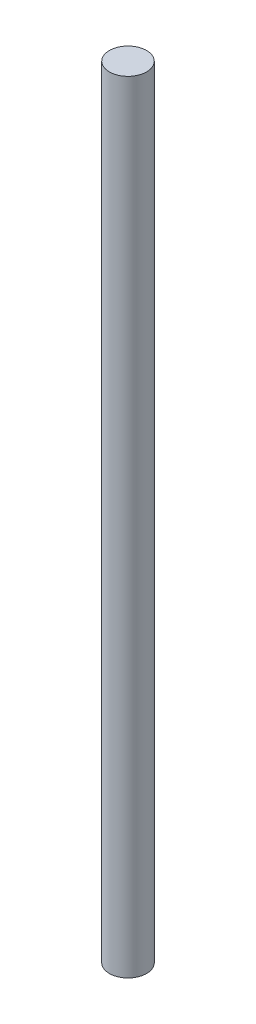
ISO-10303-21;
HEADER;
FILE_DESCRIPTION(('STEP AP214'),'2;1');
FILE_NAME('part.step','',(''),(''),'','','');
FILE_SCHEMA(('AUTOMOTIVE_DESIGN { 1 0 10303 214 1 1 1 1 }'));
ENDSEC;
DATA;
#1=APPLICATION_CONTEXT('core data for automotive mechanical design processes');
#2=APPLICATION_PROTOCOL_DEFINITION('international standard','automotive_design',2000,#1);
#3=PRODUCT_CONTEXT('',#1,'mechanical');
#4=PRODUCT('Part','Part','',(#3));
#5=PRODUCT_RELATED_PRODUCT_CATEGORY('part','',(#4));
#6=PRODUCT_DEFINITION_FORMATION('','',#4);
#7=PRODUCT_DEFINITION_CONTEXT('part definition',#1,'design');
#8=PRODUCT_DEFINITION('design','',#6,#7);
#9=PRODUCT_DEFINITION_SHAPE('','',#8);
#10=(LENGTH_UNIT() NAMED_UNIT(*) SI_UNIT(.MILLI.,.METRE.));
#11=(NAMED_UNIT(*) PLANE_ANGLE_UNIT() SI_UNIT($,.RADIAN.));
#12=(NAMED_UNIT(*) SI_UNIT($,.STERADIAN.) SOLID_ANGLE_UNIT());
#13=UNCERTAINTY_MEASURE_WITH_UNIT(LENGTH_MEASURE(1.E-05),#10,'distance_accuracy_value','');
#14=(GEOMETRIC_REPRESENTATION_CONTEXT(3) GLOBAL_UNCERTAINTY_ASSIGNED_CONTEXT((#13)) GLOBAL_UNIT_ASSIGNED_CONTEXT((#10,
#11,#12)) REPRESENTATION_CONTEXT('',''));
#15=CARTESIAN_POINT('',(0.,0.,0.));
#16=DIRECTION('',(0.,0.,1.));
#17=DIRECTION('',(1.,0.,0.));
#18=AXIS2_PLACEMENT_3D('',#15,#16,#17);
#19=CARTESIAN_POINT('',(0.,168.,0.));
#20=DIRECTION('',(0.,-1.,0.));
#21=DIRECTION('',(0.,0.,-1.));
#22=AXIS2_PLACEMENT_3D('',#19,#20,#21);
#23=CYLINDRICAL_SURFACE('',#22,4.);
#24=CARTESIAN_POINT('',(0.,168.,0.));
#25=DIRECTION('',(0.,1.,0.));
#26=DIRECTION('',(0.,0.,1.));
#27=AXIS2_PLACEMENT_3D('',#24,#25,#26);
#28=CIRCLE('',#27,4.);
#29=CARTESIAN_POINT('',(0.,168.,4.));
#30=VERTEX_POINT('',#29);
#31=EDGE_CURVE('E10',#30,#30,#28,.T.);
#32=ORIENTED_EDGE('',*,*,#31,.F.);
#33=EDGE_LOOP('',(#32));
#34=FACE_BOUND('',#33,.T.);
#35=CARTESIAN_POINT('',(0.,0.,0.));
#36=DIRECTION('',(0.,1.,0.));
#37=DIRECTION('',(0.,0.,1.));
#38=AXIS2_PLACEMENT_3D('',#35,#36,#37);
#39=CIRCLE('',#38,4.);
#40=CARTESIAN_POINT('',(0.,0.,4.));
#41=VERTEX_POINT('',#40);
#42=EDGE_CURVE('E46',#41,#41,#39,.T.);
#43=ORIENTED_EDGE('',*,*,#42,.T.);
#44=EDGE_LOOP('',(#43));
#45=FACE_BOUND('',#44,.T.);
#46=ADVANCED_FACE('F43',(#34,#45),#23,.T.);
#47=CARTESIAN_POINT('',(0.,168.,0.));
#48=DIRECTION('',(0.,1.,0.));
#49=DIRECTION('',(0.,0.,1.));
#50=AXIS2_PLACEMENT_3D('',#47,#48,#49);
#51=PLANE('',#50);
#52=ORIENTED_EDGE('',*,*,#31,.T.);
#53=EDGE_LOOP('',(#52));
#54=FACE_BOUND('',#53,.T.);
#55=ADVANCED_FACE('F60',(#54),#51,.T.);
#56=CARTESIAN_POINT('',(0.,0.,0.));
#57=DIRECTION('',(0.,1.,0.));
#58=DIRECTION('',(0.,0.,1.));
#59=AXIS2_PLACEMENT_3D('',#56,#57,#58);
#60=PLANE('',#59);
#61=ORIENTED_EDGE('',*,*,#42,.F.);
#62=EDGE_LOOP('',(#61));
#63=FACE_BOUND('',#62,.T.);
#64=ADVANCED_FACE('F58',(#63),#60,.F.);
#65=CLOSED_SHELL('',(#46,#55,#64));
#66=MANIFOLD_SOLID_BREP('B2',#65);
#67=ADVANCED_BREP_SHAPE_REPRESENTATION('',(#18,#66),#14);
#68=SHAPE_DEFINITION_REPRESENTATION(#9,#67);
ENDSEC;
END-ISO-10303-21;
